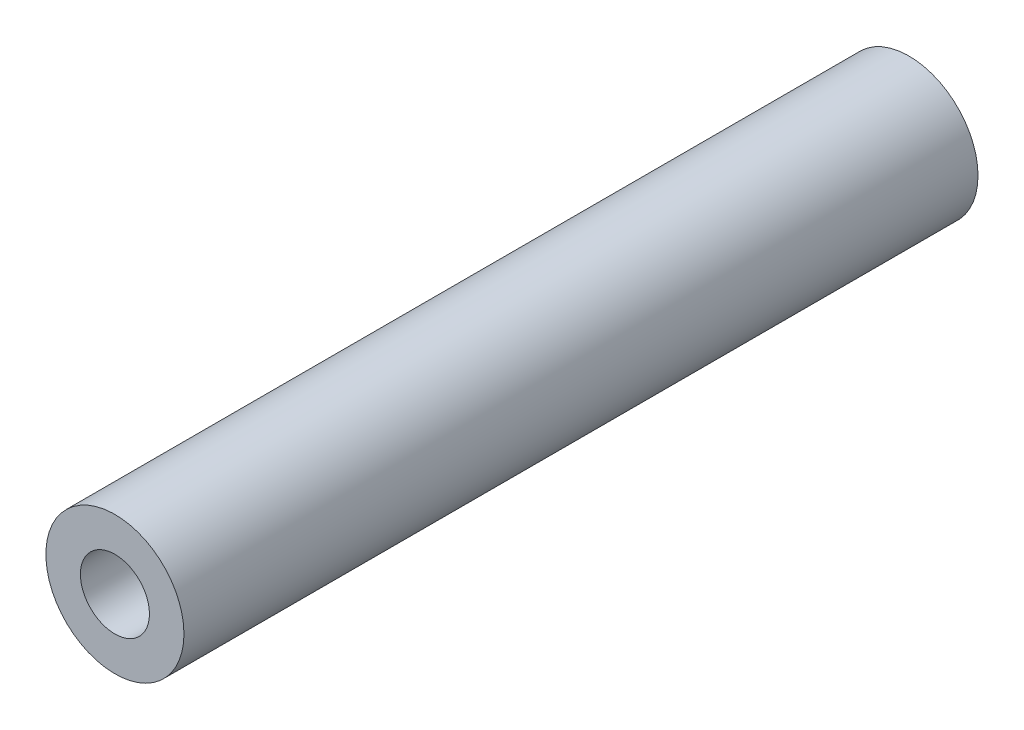
ISO-10303-21;
HEADER;
FILE_DESCRIPTION(('STEP AP214'),'2;1');
FILE_NAME('part.step','',(''),(''),'','','');
FILE_SCHEMA(('AUTOMOTIVE_DESIGN { 1 0 10303 214 1 1 1 1 }'));
ENDSEC;
DATA;
#1=APPLICATION_CONTEXT('core data for automotive mechanical design processes');
#2=APPLICATION_PROTOCOL_DEFINITION('international standard','automotive_design',2000,#1);
#3=PRODUCT_CONTEXT('',#1,'mechanical');
#4=PRODUCT('Part','Part','',(#3));
#5=PRODUCT_RELATED_PRODUCT_CATEGORY('part','',(#4));
#6=PRODUCT_DEFINITION_FORMATION('','',#4);
#7=PRODUCT_DEFINITION_CONTEXT('part definition',#1,'design');
#8=PRODUCT_DEFINITION('design','',#6,#7);
#9=PRODUCT_DEFINITION_SHAPE('','',#8);
#10=(LENGTH_UNIT() NAMED_UNIT(*) SI_UNIT(.MILLI.,.METRE.));
#11=(NAMED_UNIT(*) PLANE_ANGLE_UNIT() SI_UNIT($,.RADIAN.));
#12=(NAMED_UNIT(*) SI_UNIT($,.STERADIAN.) SOLID_ANGLE_UNIT());
#13=UNCERTAINTY_MEASURE_WITH_UNIT(LENGTH_MEASURE(1.E-05),#10,'distance_accuracy_value','');
#14=(GEOMETRIC_REPRESENTATION_CONTEXT(3) GLOBAL_UNCERTAINTY_ASSIGNED_CONTEXT((#13)) GLOBAL_UNIT_ASSIGNED_CONTEXT((#10,
#11,#12)) REPRESENTATION_CONTEXT('',''));
#15=CARTESIAN_POINT('',(0.,0.,0.));
#16=DIRECTION('',(0.,0.,1.));
#17=DIRECTION('',(1.,0.,0.));
#18=AXIS2_PLACEMENT_3D('',#15,#16,#17);
#19=CARTESIAN_POINT('',(0.,0.,46.));
#20=DIRECTION('',(0.,0.,-1.));
#21=DIRECTION('',(-1.,0.,0.));
#22=AXIS2_PLACEMENT_3D('',#19,#20,#21);
#23=CYLINDRICAL_SURFACE('',#22,4.);
#24=CARTESIAN_POINT('',(0.,0.,46.));
#25=DIRECTION('',(0.,0.,1.));
#26=DIRECTION('',(1.,0.,0.));
#27=AXIS2_PLACEMENT_3D('',#24,#25,#26);
#28=CIRCLE('',#27,4.);
#29=CARTESIAN_POINT('',(4.,0.,46.));
#30=VERTEX_POINT('',#29);
#31=EDGE_CURVE('E10',#30,#30,#28,.T.);
#32=ORIENTED_EDGE('',*,*,#31,.F.);
#33=EDGE_LOOP('',(#32));
#34=FACE_BOUND('',#33,.T.);
#35=CARTESIAN_POINT('',(0.,0.,0.));
#36=DIRECTION('',(0.,0.,1.));
#37=DIRECTION('',(1.,0.,0.));
#38=AXIS2_PLACEMENT_3D('',#35,#36,#37);
#39=CIRCLE('',#38,4.);
#40=CARTESIAN_POINT('',(4.,0.,0.));
#41=VERTEX_POINT('',#40);
#42=EDGE_CURVE('E31',#41,#41,#39,.T.);
#43=ORIENTED_EDGE('',*,*,#42,.T.);
#44=EDGE_LOOP('',(#43));
#45=FACE_BOUND('',#44,.T.);
#46=ADVANCED_FACE('F28',(#34,#45),#23,.T.);
#47=CARTESIAN_POINT('',(0.,0.,46.));
#48=DIRECTION('',(0.,0.,1.));
#49=DIRECTION('',(1.,0.,0.));
#50=AXIS2_PLACEMENT_3D('',#47,#48,#49);
#51=PLANE('',#50);
#52=CARTESIAN_POINT('',(0.,0.,46.));
#53=DIRECTION('',(0.,0.,1.));
#54=DIRECTION('',(1.,0.,0.));
#55=AXIS2_PLACEMENT_3D('',#52,#53,#54);
#56=CIRCLE('',#55,2.);
#57=CARTESIAN_POINT('',(2.,0.,46.));
#58=VERTEX_POINT('',#57);
#59=EDGE_CURVE('E40',#58,#58,#56,.T.);
#60=ORIENTED_EDGE('',*,*,#59,.F.);
#61=EDGE_LOOP('',(#60));
#62=FACE_BOUND('',#61,.T.);
#63=ORIENTED_EDGE('',*,*,#31,.T.);
#64=EDGE_LOOP('',(#63));
#65=FACE_BOUND('',#64,.T.);
#66=ADVANCED_FACE('F65',(#62,#65),#51,.T.);
#67=CARTESIAN_POINT('',(0.,0.,0.));
#68=DIRECTION('',(0.,0.,1.));
#69=DIRECTION('',(1.,0.,0.));
#70=AXIS2_PLACEMENT_3D('',#67,#68,#69);
#71=PLANE('',#70);
#72=CARTESIAN_POINT('',(0.,0.,0.));
#73=DIRECTION('',(0.,0.,-1.));
#74=DIRECTION('',(-1.,0.,0.));
#75=AXIS2_PLACEMENT_3D('',#72,#73,#74);
#76=CIRCLE('',#75,2.);
#77=CARTESIAN_POINT('',(-2.,0.,0.));
#78=VERTEX_POINT('',#77);
#79=EDGE_CURVE('E46',#78,#78,#76,.T.);
#80=ORIENTED_EDGE('',*,*,#79,.F.);
#81=EDGE_LOOP('',(#80));
#82=FACE_BOUND('',#81,.T.);
#83=ORIENTED_EDGE('',*,*,#42,.F.);
#84=EDGE_LOOP('',(#83));
#85=FACE_BOUND('',#84,.T.);
#86=ADVANCED_FACE('F61',(#82,#85),#71,.F.);
#87=CARTESIAN_POINT('',(0.,0.,36.));
#88=DIRECTION('',(0.,0.,1.));
#89=DIRECTION('',(1.,0.,0.));
#90=AXIS2_PLACEMENT_3D('',#87,#88,#89);
#91=CYLINDRICAL_SURFACE('',#90,2.);
#92=CARTESIAN_POINT('',(0.,0.,36.));
#93=DIRECTION('',(0.,0.,1.));
#94=DIRECTION('',(1.,0.,0.));
#95=AXIS2_PLACEMENT_3D('',#92,#93,#94);
#96=CIRCLE('',#95,2.);
#97=CARTESIAN_POINT('',(2.,0.,36.));
#98=VERTEX_POINT('',#97);
#99=EDGE_CURVE('E38',#98,#98,#96,.T.);
#100=ORIENTED_EDGE('',*,*,#99,.F.);
#101=EDGE_LOOP('',(#100));
#102=FACE_BOUND('',#101,.T.);
#103=ORIENTED_EDGE('',*,*,#59,.T.);
#104=EDGE_LOOP('',(#103));
#105=FACE_BOUND('',#104,.T.);
#106=ADVANCED_FACE('F64',(#102,#105),#91,.F.);
#107=CARTESIAN_POINT('',(0.,0.,36.));
#108=DIRECTION('',(0.,0.,1.));
#109=DIRECTION('',(1.,0.,0.));
#110=AXIS2_PLACEMENT_3D('',#107,#108,#109);
#111=PLANE('',#110);
#112=ORIENTED_EDGE('',*,*,#99,.T.);
#113=EDGE_LOOP('',(#112));
#114=FACE_BOUND('',#113,.T.);
#115=ADVANCED_FACE('F57',(#114),#111,.T.);
#116=CARTESIAN_POINT('',(0.,0.,10.));
#117=DIRECTION('',(0.,0.,-1.));
#118=DIRECTION('',(-1.,0.,0.));
#119=AXIS2_PLACEMENT_3D('',#116,#117,#118);
#120=CYLINDRICAL_SURFACE('',#119,2.);
#121=CARTESIAN_POINT('',(0.,0.,10.));
#122=DIRECTION('',(0.,0.,-1.));
#123=DIRECTION('',(-1.,0.,0.));
#124=AXIS2_PLACEMENT_3D('',#121,#122,#123);
#125=CIRCLE('',#124,2.);
#126=CARTESIAN_POINT('',(-2.,0.,10.));
#127=VERTEX_POINT('',#126);
#128=EDGE_CURVE('E43',#127,#127,#125,.T.);
#129=ORIENTED_EDGE('',*,*,#128,.F.);
#130=EDGE_LOOP('',(#129));
#131=FACE_BOUND('',#130,.T.);
#132=ORIENTED_EDGE('',*,*,#79,.T.);
#133=EDGE_LOOP('',(#132));
#134=FACE_BOUND('',#133,.T.);
#135=ADVANCED_FACE('F54',(#131,#134),#120,.F.);
#136=CARTESIAN_POINT('',(0.,0.,10.));
#137=DIRECTION('',(0.,0.,-1.));
#138=DIRECTION('',(-1.,0.,0.));
#139=AXIS2_PLACEMENT_3D('',#136,#137,#138);
#140=PLANE('',#139);
#141=ORIENTED_EDGE('',*,*,#128,.T.);
#142=EDGE_LOOP('',(#141));
#143=FACE_BOUND('',#142,.T.);
#144=ADVANCED_FACE('F52',(#143),#140,.T.);
#145=CLOSED_SHELL('',(#46,#66,#86,#106,#115,#135,#144));
#146=MANIFOLD_SOLID_BREP('B2',#145);
#147=ADVANCED_BREP_SHAPE_REPRESENTATION('',(#18,#146),#14);
#148=SHAPE_DEFINITION_REPRESENTATION(#9,#147);
ENDSEC;
END-ISO-10303-21;
